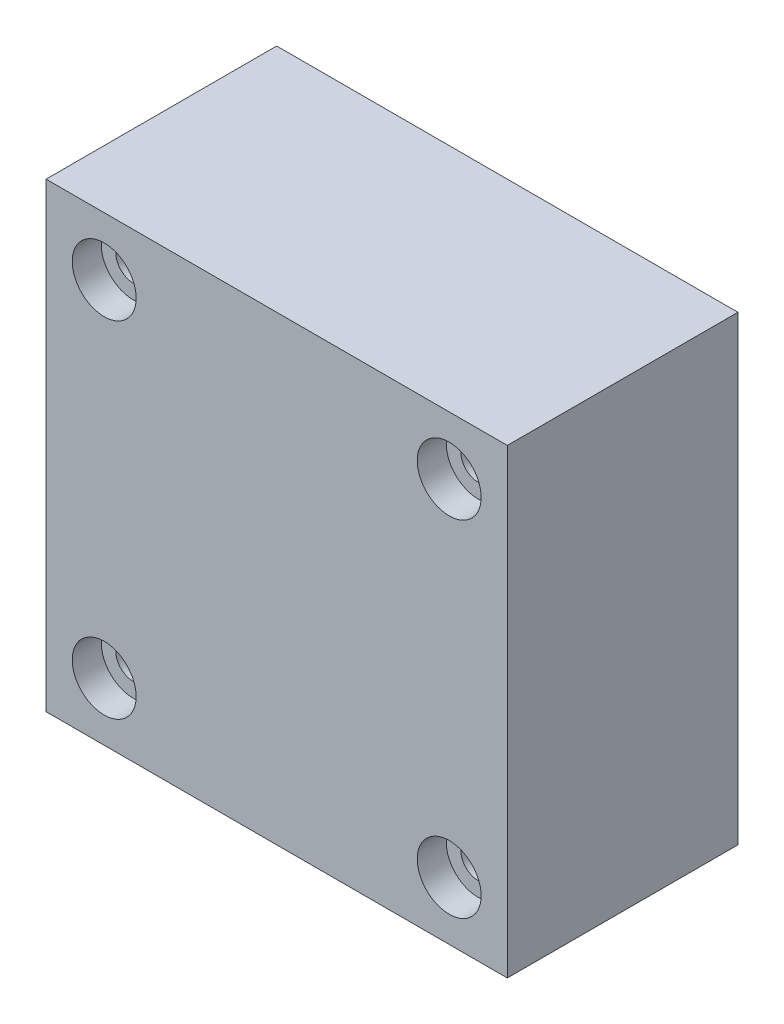
ISO-10303-21;
HEADER;
FILE_DESCRIPTION(('STEP AP214'),'2;1');
FILE_NAME('part.step','',(''),(''),'','','');
FILE_SCHEMA(('AUTOMOTIVE_DESIGN { 1 0 10303 214 1 1 1 1 }'));
ENDSEC;
DATA;
#1=APPLICATION_CONTEXT('core data for automotive mechanical design processes');
#2=APPLICATION_PROTOCOL_DEFINITION('international standard','automotive_design',2000,#1);
#3=PRODUCT_CONTEXT('',#1,'mechanical');
#4=PRODUCT('Part','Part','',(#3));
#5=PRODUCT_RELATED_PRODUCT_CATEGORY('part','',(#4));
#6=PRODUCT_DEFINITION_FORMATION('','',#4);
#7=PRODUCT_DEFINITION_CONTEXT('part definition',#1,'design');
#8=PRODUCT_DEFINITION('design','',#6,#7);
#9=PRODUCT_DEFINITION_SHAPE('','',#8);
#10=(LENGTH_UNIT() NAMED_UNIT(*) SI_UNIT(.MILLI.,.METRE.));
#11=(NAMED_UNIT(*) PLANE_ANGLE_UNIT() SI_UNIT($,.RADIAN.));
#12=(NAMED_UNIT(*) SI_UNIT($,.STERADIAN.) SOLID_ANGLE_UNIT());
#13=UNCERTAINTY_MEASURE_WITH_UNIT(LENGTH_MEASURE(1.E-05),#10,'distance_accuracy_value','');
#14=(GEOMETRIC_REPRESENTATION_CONTEXT(3) GLOBAL_UNCERTAINTY_ASSIGNED_CONTEXT((#13)) GLOBAL_UNIT_ASSIGNED_CONTEXT((#10,
#11,#12)) REPRESENTATION_CONTEXT('',''));
#15=CARTESIAN_POINT('',(0.,0.,0.));
#16=DIRECTION('',(0.,0.,1.));
#17=DIRECTION('',(1.,0.,0.));
#18=AXIS2_PLACEMENT_3D('',#15,#16,#17);
#19=CARTESIAN_POINT('',(0.,0.,-7.9375));
#20=DIRECTION('',(0.,0.,-1.));
#21=DIRECTION('',(-1.,0.,0.));
#22=AXIS2_PLACEMENT_3D('',#19,#20,#21);
#23=PLANE('',#22);
#24=CARTESIAN_POINT('',(-11.875,11.875,-7.9375));
#25=DIRECTION('',(0.,0.,1.));
#26=DIRECTION('',(1.,0.,0.));
#27=AXIS2_PLACEMENT_3D('',#24,#25,#26);
#28=CIRCLE('',#27,1.2);
#29=CARTESIAN_POINT('',(-10.675,11.875,-7.9375));
#30=VERTEX_POINT('',#29);
#31=EDGE_CURVE('E148',#30,#30,#28,.T.);
#32=ORIENTED_EDGE('',*,*,#31,.T.);
#33=EDGE_LOOP('',(#32));
#34=FACE_BOUND('',#33,.T.);
#35=CARTESIAN_POINT('',(11.875,11.875,-7.9375));
#36=DIRECTION('',(0.,0.,1.));
#37=DIRECTION('',(1.,0.,0.));
#38=AXIS2_PLACEMENT_3D('',#35,#36,#37);
#39=CIRCLE('',#38,1.2);
#40=CARTESIAN_POINT('',(13.075,11.875,-7.9375));
#41=VERTEX_POINT('',#40);
#42=EDGE_CURVE('E136',#41,#41,#39,.T.);
#43=ORIENTED_EDGE('',*,*,#42,.T.);
#44=EDGE_LOOP('',(#43));
#45=FACE_BOUND('',#44,.T.);
#46=DIRECTION('',(0.,1.,0.));
#47=VECTOR('',#46,1.);
#48=CARTESIAN_POINT('',(15.875,-15.875,-7.9375));
#49=LINE('',#48,#47);
#50=CARTESIAN_POINT('',(15.875,-15.875,-7.9375));
#51=VERTEX_POINT('',#50);
#52=CARTESIAN_POINT('',(15.875,15.875,-7.9375));
#53=VERTEX_POINT('',#52);
#54=EDGE_CURVE('E99',#51,#53,#49,.T.);
#55=ORIENTED_EDGE('',*,*,#54,.F.);
#56=DIRECTION('',(1.,0.,0.));
#57=VECTOR('',#56,1.);
#58=CARTESIAN_POINT('',(-15.875,-15.875,-7.9375));
#59=LINE('',#58,#57);
#60=CARTESIAN_POINT('',(-15.875,-15.875,-7.9375));
#61=VERTEX_POINT('',#60);
#62=EDGE_CURVE('E75',#61,#51,#59,.T.);
#63=ORIENTED_EDGE('',*,*,#62,.F.);
#64=DIRECTION('',(0.,-1.,0.));
#65=VECTOR('',#64,1.);
#66=CARTESIAN_POINT('',(-15.875,-15.875,-7.9375));
#67=LINE('',#66,#65);
#68=CARTESIAN_POINT('',(-15.875,15.875,-7.9375));
#69=VERTEX_POINT('',#68);
#70=EDGE_CURVE('E69',#69,#61,#67,.T.);
#71=ORIENTED_EDGE('',*,*,#70,.F.);
#72=DIRECTION('',(-1.,0.,0.));
#73=VECTOR('',#72,1.);
#74=CARTESIAN_POINT('',(-15.875,15.875,-7.9375));
#75=LINE('',#74,#73);
#76=EDGE_CURVE('E91',#53,#69,#75,.T.);
#77=ORIENTED_EDGE('',*,*,#76,.F.);
#78=EDGE_LOOP('',(#55,#63,#71,#77));
#79=FACE_BOUND('',#78,.T.);
#80=CARTESIAN_POINT('',(-11.875,-11.875,-7.9375));
#81=DIRECTION('',(0.,0.,1.));
#82=DIRECTION('',(1.,0.,0.));
#83=AXIS2_PLACEMENT_3D('',#80,#81,#82);
#84=CIRCLE('',#83,1.2);
#85=CARTESIAN_POINT('',(-10.675,-11.875,-7.9375));
#86=VERTEX_POINT('',#85);
#87=EDGE_CURVE('E102',#86,#86,#84,.T.);
#88=ORIENTED_EDGE('',*,*,#87,.T.);
#89=EDGE_LOOP('',(#88));
#90=FACE_BOUND('',#89,.T.);
#91=CARTESIAN_POINT('',(11.875,-11.875,-7.9375));
#92=DIRECTION('',(0.,0.,1.));
#93=DIRECTION('',(1.,0.,0.));
#94=AXIS2_PLACEMENT_3D('',#91,#92,#93);
#95=CIRCLE('',#94,1.2);
#96=CARTESIAN_POINT('',(13.075,-11.875,-7.9375));
#97=VERTEX_POINT('',#96);
#98=EDGE_CURVE('E124',#97,#97,#95,.T.);
#99=ORIENTED_EDGE('',*,*,#98,.T.);
#100=EDGE_LOOP('',(#99));
#101=FACE_BOUND('',#100,.T.);
#102=ADVANCED_FACE('F35',(#34,#45,#79,#90,#101),#23,.T.);
#103=CARTESIAN_POINT('',(15.875,-15.875,7.9375));
#104=DIRECTION('',(-1.,0.,0.));
#105=DIRECTION('',(0.,0.,1.));
#106=AXIS2_PLACEMENT_3D('',#103,#104,#105);
#107=PLANE('',#106);
#108=ORIENTED_EDGE('',*,*,#54,.T.);
#109=DIRECTION('',(0.,0.,-1.));
#110=VECTOR('',#109,1.);
#111=CARTESIAN_POINT('',(15.875,15.875,7.9375));
#112=LINE('',#111,#110);
#113=CARTESIAN_POINT('',(15.875,15.875,7.9375));
#114=VERTEX_POINT('',#113);
#115=EDGE_CURVE('E11',#114,#53,#112,.T.);
#116=ORIENTED_EDGE('',*,*,#115,.F.);
#117=DIRECTION('',(0.,1.,0.));
#118=VECTOR('',#117,1.);
#119=CARTESIAN_POINT('',(15.875,-15.875,7.9375));
#120=LINE('',#119,#118);
#121=CARTESIAN_POINT('',(15.875,-15.875,7.9375));
#122=VERTEX_POINT('',#121);
#123=EDGE_CURVE('E87',#122,#114,#120,.T.);
#124=ORIENTED_EDGE('',*,*,#123,.F.);
#125=DIRECTION('',(0.,0.,-1.));
#126=VECTOR('',#125,1.);
#127=CARTESIAN_POINT('',(15.875,-15.875,7.9375));
#128=LINE('',#127,#126);
#129=EDGE_CURVE('E95',#122,#51,#128,.T.);
#130=ORIENTED_EDGE('',*,*,#129,.T.);
#131=EDGE_LOOP('',(#108,#116,#124,#130));
#132=FACE_BOUND('',#131,.T.);
#133=ADVANCED_FACE('F37',(#132),#107,.F.);
#134=CARTESIAN_POINT('',(-15.875,15.875,7.9375));
#135=DIRECTION('',(0.,-1.,0.));
#136=DIRECTION('',(0.,0.,-1.));
#137=AXIS2_PLACEMENT_3D('',#134,#135,#136);
#138=PLANE('',#137);
#139=ORIENTED_EDGE('',*,*,#76,.T.);
#140=DIRECTION('',(0.,0.,-1.));
#141=VECTOR('',#140,1.);
#142=CARTESIAN_POINT('',(-15.875,15.875,7.9375));
#143=LINE('',#142,#141);
#144=CARTESIAN_POINT('',(-15.875,15.875,7.9375));
#145=VERTEX_POINT('',#144);
#146=EDGE_CURVE('E44',#145,#69,#143,.T.);
#147=ORIENTED_EDGE('',*,*,#146,.F.);
#148=DIRECTION('',(-1.,0.,0.));
#149=VECTOR('',#148,1.);
#150=CARTESIAN_POINT('',(-15.875,15.875,7.9375));
#151=LINE('',#150,#149);
#152=EDGE_CURVE('E82',#114,#145,#151,.T.);
#153=ORIENTED_EDGE('',*,*,#152,.F.);
#154=ORIENTED_EDGE('',*,*,#115,.T.);
#155=EDGE_LOOP('',(#139,#147,#153,#154));
#156=FACE_BOUND('',#155,.T.);
#157=ADVANCED_FACE('F90',(#156),#138,.F.);
#158=CARTESIAN_POINT('',(-15.875,-15.875,7.9375));
#159=DIRECTION('',(1.,0.,0.));
#160=DIRECTION('',(0.,0.,-1.));
#161=AXIS2_PLACEMENT_3D('',#158,#159,#160);
#162=PLANE('',#161);
#163=ORIENTED_EDGE('',*,*,#70,.T.);
#164=DIRECTION('',(0.,0.,-1.));
#165=VECTOR('',#164,1.);
#166=CARTESIAN_POINT('',(-15.875,-15.875,7.9375));
#167=LINE('',#166,#165);
#168=CARTESIAN_POINT('',(-15.875,-15.875,7.9375));
#169=VERTEX_POINT('',#168);
#170=EDGE_CURVE('E92',#169,#61,#167,.T.);
#171=ORIENTED_EDGE('',*,*,#170,.F.);
#172=DIRECTION('',(0.,-1.,0.));
#173=VECTOR('',#172,1.);
#174=CARTESIAN_POINT('',(-15.875,-15.875,7.9375));
#175=LINE('',#174,#173);
#176=EDGE_CURVE('E85',#145,#169,#175,.T.);
#177=ORIENTED_EDGE('',*,*,#176,.F.);
#178=ORIENTED_EDGE('',*,*,#146,.T.);
#179=EDGE_LOOP('',(#163,#171,#177,#178));
#180=FACE_BOUND('',#179,.T.);
#181=ADVANCED_FACE('F93',(#180),#162,.F.);
#182=CARTESIAN_POINT('',(-15.875,-15.875,7.9375));
#183=DIRECTION('',(0.,1.,0.));
#184=DIRECTION('',(0.,0.,1.));
#185=AXIS2_PLACEMENT_3D('',#182,#183,#184);
#186=PLANE('',#185);
#187=ORIENTED_EDGE('',*,*,#62,.T.);
#188=ORIENTED_EDGE('',*,*,#129,.F.);
#189=DIRECTION('',(1.,0.,0.));
#190=VECTOR('',#189,1.);
#191=CARTESIAN_POINT('',(-15.875,-15.875,7.9375));
#192=LINE('',#191,#190);
#193=EDGE_CURVE('E52',#169,#122,#192,.T.);
#194=ORIENTED_EDGE('',*,*,#193,.F.);
#195=ORIENTED_EDGE('',*,*,#170,.T.);
#196=EDGE_LOOP('',(#187,#188,#194,#195));
#197=FACE_BOUND('',#196,.T.);
#198=ADVANCED_FACE('F107',(#197),#186,.F.);
#199=CARTESIAN_POINT('',(0.,0.,7.9375));
#200=DIRECTION('',(0.,0.,-1.));
#201=DIRECTION('',(-1.,0.,0.));
#202=AXIS2_PLACEMENT_3D('',#199,#200,#201);
#203=PLANE('',#202);
#204=CARTESIAN_POINT('',(-11.875,11.875,7.9375));
#205=DIRECTION('',(0.,0.,1.));
#206=DIRECTION('',(1.,0.,0.));
#207=AXIS2_PLACEMENT_3D('',#204,#205,#206);
#208=CIRCLE('',#207,2.2);
#209=CARTESIAN_POINT('',(-9.675,11.875,7.9375));
#210=VERTEX_POINT('',#209);
#211=EDGE_CURVE('E157',#210,#210,#208,.T.);
#212=ORIENTED_EDGE('',*,*,#211,.F.);
#213=EDGE_LOOP('',(#212));
#214=FACE_BOUND('',#213,.T.);
#215=CARTESIAN_POINT('',(11.875,11.875,7.9375));
#216=DIRECTION('',(0.,0.,1.));
#217=DIRECTION('',(1.,0.,0.));
#218=AXIS2_PLACEMENT_3D('',#215,#216,#217);
#219=CIRCLE('',#218,2.2);
#220=CARTESIAN_POINT('',(14.075,11.875,7.9375));
#221=VERTEX_POINT('',#220);
#222=EDGE_CURVE('E145',#221,#221,#219,.T.);
#223=ORIENTED_EDGE('',*,*,#222,.F.);
#224=EDGE_LOOP('',(#223));
#225=FACE_BOUND('',#224,.T.);
#226=CARTESIAN_POINT('',(11.875,-11.875,7.9375));
#227=DIRECTION('',(0.,0.,1.));
#228=DIRECTION('',(1.,0.,0.));
#229=AXIS2_PLACEMENT_3D('',#226,#227,#228);
#230=CIRCLE('',#229,2.2);
#231=CARTESIAN_POINT('',(14.075,-11.875,7.9375));
#232=VERTEX_POINT('',#231);
#233=EDGE_CURVE('E133',#232,#232,#230,.T.);
#234=ORIENTED_EDGE('',*,*,#233,.F.);
#235=EDGE_LOOP('',(#234));
#236=FACE_BOUND('',#235,.T.);
#237=CARTESIAN_POINT('',(-11.875,-11.875,7.9375));
#238=DIRECTION('',(0.,0.,1.));
#239=DIRECTION('',(1.,0.,0.));
#240=AXIS2_PLACEMENT_3D('',#237,#238,#239);
#241=CIRCLE('',#240,2.2);
#242=CARTESIAN_POINT('',(-9.67499999999999,-11.875,7.9375));
#243=VERTEX_POINT('',#242);
#244=EDGE_CURVE('E121',#243,#243,#241,.T.);
#245=ORIENTED_EDGE('',*,*,#244,.F.);
#246=EDGE_LOOP('',(#245));
#247=FACE_BOUND('',#246,.T.);
#248=ORIENTED_EDGE('',*,*,#123,.T.);
#249=ORIENTED_EDGE('',*,*,#152,.T.);
#250=ORIENTED_EDGE('',*,*,#176,.T.);
#251=ORIENTED_EDGE('',*,*,#193,.T.);
#252=EDGE_LOOP('',(#248,#249,#250,#251));
#253=FACE_BOUND('',#252,.T.);
#254=ADVANCED_FACE('F83',(#214,#225,#236,#247,#253),#203,.F.);
#255=CARTESIAN_POINT('',(-11.875,-11.875,7.9375));
#256=DIRECTION('',(0.,0.,1.));
#257=DIRECTION('',(1.,0.,0.));
#258=AXIS2_PLACEMENT_3D('',#255,#256,#257);
#259=CYLINDRICAL_SURFACE('',#258,1.2);
#260=ORIENTED_EDGE('',*,*,#87,.F.);
#261=EDGE_LOOP('',(#260));
#262=FACE_BOUND('',#261,.T.);
#263=CARTESIAN_POINT('',(-11.875,-11.875,5.9375));
#264=DIRECTION('',(0.,0.,1.));
#265=DIRECTION('',(1.,0.,0.));
#266=AXIS2_PLACEMENT_3D('',#263,#264,#265);
#267=CIRCLE('',#266,1.2);
#268=CARTESIAN_POINT('',(-10.675,-11.875,5.9375));
#269=VERTEX_POINT('',#268);
#270=EDGE_CURVE('E115',#269,#269,#267,.T.);
#271=ORIENTED_EDGE('',*,*,#270,.T.);
#272=EDGE_LOOP('',(#271));
#273=FACE_BOUND('',#272,.T.);
#274=ADVANCED_FACE('F165',(#262,#273),#259,.F.);
#275=CARTESIAN_POINT('',(-10.675,-11.875,5.9375));
#276=DIRECTION('',(0.,0.,-1.));
#277=DIRECTION('',(-1.,0.,0.));
#278=AXIS2_PLACEMENT_3D('',#275,#276,#277);
#279=PLANE('',#278);
#280=ORIENTED_EDGE('',*,*,#270,.F.);
#281=EDGE_LOOP('',(#280));
#282=FACE_BOUND('',#281,.T.);
#283=CARTESIAN_POINT('',(-11.875,-11.875,5.9375));
#284=DIRECTION('',(0.,0.,1.));
#285=DIRECTION('',(1.,0.,0.));
#286=AXIS2_PLACEMENT_3D('',#283,#284,#285);
#287=CIRCLE('',#286,2.2);
#288=CARTESIAN_POINT('',(-9.67499999999999,-11.875,5.9375));
#289=VERTEX_POINT('',#288);
#290=EDGE_CURVE('E118',#289,#289,#287,.T.);
#291=ORIENTED_EDGE('',*,*,#290,.T.);
#292=EDGE_LOOP('',(#291));
#293=FACE_BOUND('',#292,.T.);
#294=ADVANCED_FACE('F176',(#282,#293),#279,.F.);
#295=CARTESIAN_POINT('',(-11.875,-11.875,7.9375));
#296=DIRECTION('',(0.,0.,1.));
#297=DIRECTION('',(1.,0.,0.));
#298=AXIS2_PLACEMENT_3D('',#295,#296,#297);
#299=CYLINDRICAL_SURFACE('',#298,2.2);
#300=ORIENTED_EDGE('',*,*,#290,.F.);
#301=EDGE_LOOP('',(#300));
#302=FACE_BOUND('',#301,.T.);
#303=ORIENTED_EDGE('',*,*,#244,.T.);
#304=EDGE_LOOP('',(#303));
#305=FACE_BOUND('',#304,.T.);
#306=ADVANCED_FACE('F173',(#302,#305),#299,.F.);
#307=CARTESIAN_POINT('',(11.875,-11.875,7.9375));
#308=DIRECTION('',(0.,0.,1.));
#309=DIRECTION('',(1.,0.,0.));
#310=AXIS2_PLACEMENT_3D('',#307,#308,#309);
#311=CYLINDRICAL_SURFACE('',#310,1.2);
#312=ORIENTED_EDGE('',*,*,#98,.F.);
#313=EDGE_LOOP('',(#312));
#314=FACE_BOUND('',#313,.T.);
#315=CARTESIAN_POINT('',(11.875,-11.875,5.9375));
#316=DIRECTION('',(0.,0.,1.));
#317=DIRECTION('',(1.,0.,0.));
#318=AXIS2_PLACEMENT_3D('',#315,#316,#317);
#319=CIRCLE('',#318,1.2);
#320=CARTESIAN_POINT('',(13.075,-11.875,5.9375));
#321=VERTEX_POINT('',#320);
#322=EDGE_CURVE('E127',#321,#321,#319,.T.);
#323=ORIENTED_EDGE('',*,*,#322,.T.);
#324=EDGE_LOOP('',(#323));
#325=FACE_BOUND('',#324,.T.);
#326=ADVANCED_FACE('F175',(#314,#325),#311,.F.);
#327=CARTESIAN_POINT('',(13.075,-11.875,5.9375));
#328=DIRECTION('',(0.,0.,-1.));
#329=DIRECTION('',(-1.,0.,0.));
#330=AXIS2_PLACEMENT_3D('',#327,#328,#329);
#331=PLANE('',#330);
#332=ORIENTED_EDGE('',*,*,#322,.F.);
#333=EDGE_LOOP('',(#332));
#334=FACE_BOUND('',#333,.T.);
#335=CARTESIAN_POINT('',(11.875,-11.875,5.9375));
#336=DIRECTION('',(0.,0.,1.));
#337=DIRECTION('',(1.,0.,0.));
#338=AXIS2_PLACEMENT_3D('',#335,#336,#337);
#339=CIRCLE('',#338,2.2);
#340=CARTESIAN_POINT('',(14.075,-11.875,5.9375));
#341=VERTEX_POINT('',#340);
#342=EDGE_CURVE('E130',#341,#341,#339,.T.);
#343=ORIENTED_EDGE('',*,*,#342,.T.);
#344=EDGE_LOOP('',(#343));
#345=FACE_BOUND('',#344,.T.);
#346=ADVANCED_FACE('F183',(#334,#345),#331,.F.);
#347=CARTESIAN_POINT('',(11.875,-11.875,7.9375));
#348=DIRECTION('',(0.,0.,1.));
#349=DIRECTION('',(1.,0.,0.));
#350=AXIS2_PLACEMENT_3D('',#347,#348,#349);
#351=CYLINDRICAL_SURFACE('',#350,2.2);
#352=ORIENTED_EDGE('',*,*,#342,.F.);
#353=EDGE_LOOP('',(#352));
#354=FACE_BOUND('',#353,.T.);
#355=ORIENTED_EDGE('',*,*,#233,.T.);
#356=EDGE_LOOP('',(#355));
#357=FACE_BOUND('',#356,.T.);
#358=ADVANCED_FACE('F247',(#354,#357),#351,.F.);
#359=CARTESIAN_POINT('',(11.875,11.875,7.9375));
#360=DIRECTION('',(0.,0.,1.));
#361=DIRECTION('',(1.,0.,0.));
#362=AXIS2_PLACEMENT_3D('',#359,#360,#361);
#363=CYLINDRICAL_SURFACE('',#362,1.2);
#364=ORIENTED_EDGE('',*,*,#42,.F.);
#365=EDGE_LOOP('',(#364));
#366=FACE_BOUND('',#365,.T.);
#367=CARTESIAN_POINT('',(11.875,11.875,5.9375));
#368=DIRECTION('',(0.,0.,1.));
#369=DIRECTION('',(1.,0.,0.));
#370=AXIS2_PLACEMENT_3D('',#367,#368,#369);
#371=CIRCLE('',#370,1.2);
#372=CARTESIAN_POINT('',(13.075,11.875,5.9375));
#373=VERTEX_POINT('',#372);
#374=EDGE_CURVE('E139',#373,#373,#371,.T.);
#375=ORIENTED_EDGE('',*,*,#374,.T.);
#376=EDGE_LOOP('',(#375));
#377=FACE_BOUND('',#376,.T.);
#378=ADVANCED_FACE('F257',(#366,#377),#363,.F.);
#379=CARTESIAN_POINT('',(13.075,11.875,5.9375));
#380=DIRECTION('',(0.,0.,-1.));
#381=DIRECTION('',(-1.,0.,0.));
#382=AXIS2_PLACEMENT_3D('',#379,#380,#381);
#383=PLANE('',#382);
#384=ORIENTED_EDGE('',*,*,#374,.F.);
#385=EDGE_LOOP('',(#384));
#386=FACE_BOUND('',#385,.T.);
#387=CARTESIAN_POINT('',(11.875,11.875,5.9375));
#388=DIRECTION('',(0.,0.,1.));
#389=DIRECTION('',(1.,0.,0.));
#390=AXIS2_PLACEMENT_3D('',#387,#388,#389);
#391=CIRCLE('',#390,2.2);
#392=CARTESIAN_POINT('',(14.075,11.875,5.9375));
#393=VERTEX_POINT('',#392);
#394=EDGE_CURVE('E142',#393,#393,#391,.T.);
#395=ORIENTED_EDGE('',*,*,#394,.T.);
#396=EDGE_LOOP('',(#395));
#397=FACE_BOUND('',#396,.T.);
#398=ADVANCED_FACE('F267',(#386,#397),#383,.F.);
#399=CARTESIAN_POINT('',(11.875,11.875,7.9375));
#400=DIRECTION('',(0.,0.,1.));
#401=DIRECTION('',(1.,0.,0.));
#402=AXIS2_PLACEMENT_3D('',#399,#400,#401);
#403=CYLINDRICAL_SURFACE('',#402,2.2);
#404=ORIENTED_EDGE('',*,*,#394,.F.);
#405=EDGE_LOOP('',(#404));
#406=FACE_BOUND('',#405,.T.);
#407=ORIENTED_EDGE('',*,*,#222,.T.);
#408=EDGE_LOOP('',(#407));
#409=FACE_BOUND('',#408,.T.);
#410=ADVANCED_FACE('F277',(#406,#409),#403,.F.);
#411=CARTESIAN_POINT('',(-11.875,11.875,7.9375));
#412=DIRECTION('',(0.,0.,1.));
#413=DIRECTION('',(1.,0.,0.));
#414=AXIS2_PLACEMENT_3D('',#411,#412,#413);
#415=CYLINDRICAL_SURFACE('',#414,1.2);
#416=ORIENTED_EDGE('',*,*,#31,.F.);
#417=EDGE_LOOP('',(#416));
#418=FACE_BOUND('',#417,.T.);
#419=CARTESIAN_POINT('',(-11.875,11.875,5.9375));
#420=DIRECTION('',(0.,0.,1.));
#421=DIRECTION('',(1.,0.,0.));
#422=AXIS2_PLACEMENT_3D('',#419,#420,#421);
#423=CIRCLE('',#422,1.2);
#424=CARTESIAN_POINT('',(-10.675,11.875,5.9375));
#425=VERTEX_POINT('',#424);
#426=EDGE_CURVE('E151',#425,#425,#423,.T.);
#427=ORIENTED_EDGE('',*,*,#426,.T.);
#428=EDGE_LOOP('',(#427));
#429=FACE_BOUND('',#428,.T.);
#430=ADVANCED_FACE('F287',(#418,#429),#415,.F.);
#431=CARTESIAN_POINT('',(-10.675,11.875,5.9375));
#432=DIRECTION('',(0.,0.,-1.));
#433=DIRECTION('',(-1.,0.,0.));
#434=AXIS2_PLACEMENT_3D('',#431,#432,#433);
#435=PLANE('',#434);
#436=ORIENTED_EDGE('',*,*,#426,.F.);
#437=EDGE_LOOP('',(#436));
#438=FACE_BOUND('',#437,.T.);
#439=CARTESIAN_POINT('',(-11.875,11.875,5.9375));
#440=DIRECTION('',(0.,0.,1.));
#441=DIRECTION('',(1.,0.,0.));
#442=AXIS2_PLACEMENT_3D('',#439,#440,#441);
#443=CIRCLE('',#442,2.2);
#444=CARTESIAN_POINT('',(-9.675,11.875,5.9375));
#445=VERTEX_POINT('',#444);
#446=EDGE_CURVE('E154',#445,#445,#443,.T.);
#447=ORIENTED_EDGE('',*,*,#446,.T.);
#448=EDGE_LOOP('',(#447));
#449=FACE_BOUND('',#448,.T.);
#450=ADVANCED_FACE('F297',(#438,#449),#435,.F.);
#451=CARTESIAN_POINT('',(-11.875,11.875,7.9375));
#452=DIRECTION('',(0.,0.,1.));
#453=DIRECTION('',(1.,0.,0.));
#454=AXIS2_PLACEMENT_3D('',#451,#452,#453);
#455=CYLINDRICAL_SURFACE('',#454,2.2);
#456=ORIENTED_EDGE('',*,*,#446,.F.);
#457=EDGE_LOOP('',(#456));
#458=FACE_BOUND('',#457,.T.);
#459=ORIENTED_EDGE('',*,*,#211,.T.);
#460=EDGE_LOOP('',(#459));
#461=FACE_BOUND('',#460,.T.);
#462=ADVANCED_FACE('F161',(#458,#461),#455,.F.);
#463=CLOSED_SHELL('',(#102,#133,#157,#181,#198,#254,#274,#294,#306,#326,#346,#358,#378,#398,
#410,#430,#450,#462));
#464=MANIFOLD_SOLID_BREP('B2',#463);
#465=ADVANCED_BREP_SHAPE_REPRESENTATION('',(#18,#464),#14);
#466=SHAPE_DEFINITION_REPRESENTATION(#9,#465);
ENDSEC;
END-ISO-10303-21;
